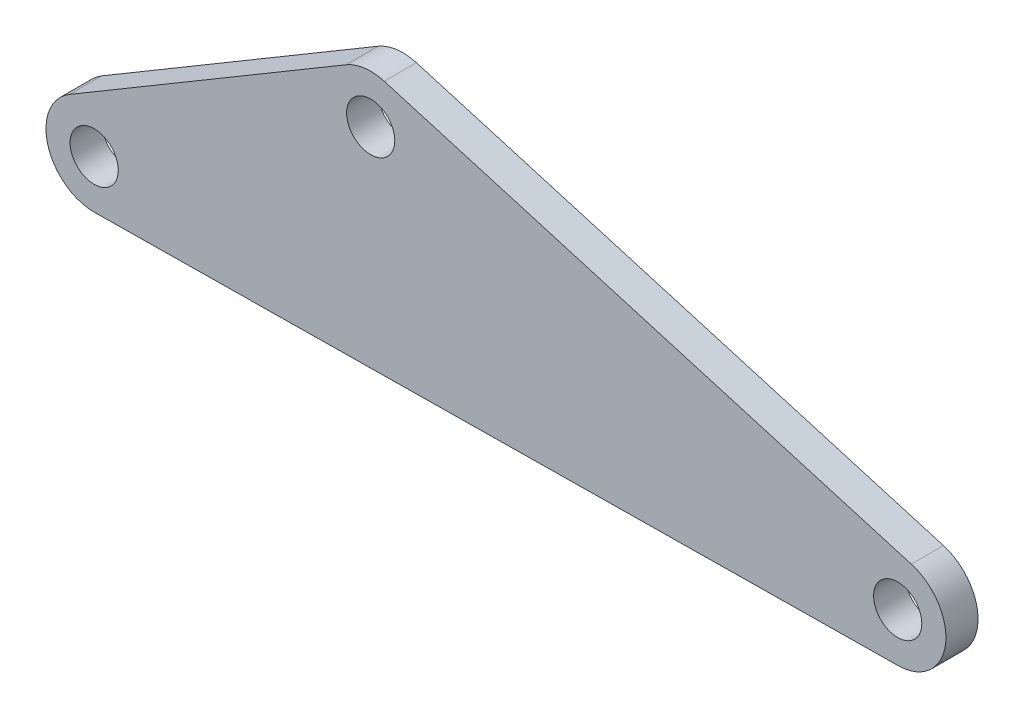
ISO-10303-21;
HEADER;
FILE_DESCRIPTION(('STEP AP214'),'2;1');
FILE_NAME('part.step','',(''),(''),'','','');
FILE_SCHEMA(('AUTOMOTIVE_DESIGN { 1 0 10303 214 1 1 1 1 }'));
ENDSEC;
DATA;
#1=APPLICATION_CONTEXT('core data for automotive mechanical design processes');
#2=APPLICATION_PROTOCOL_DEFINITION('international standard','automotive_design',2000,#1);
#3=PRODUCT_CONTEXT('',#1,'mechanical');
#4=PRODUCT('Part','Part','',(#3));
#5=PRODUCT_RELATED_PRODUCT_CATEGORY('part','',(#4));
#6=PRODUCT_DEFINITION_FORMATION('','',#4);
#7=PRODUCT_DEFINITION_CONTEXT('part definition',#1,'design');
#8=PRODUCT_DEFINITION('design','',#6,#7);
#9=PRODUCT_DEFINITION_SHAPE('','',#8);
#10=(LENGTH_UNIT() NAMED_UNIT(*) SI_UNIT(.MILLI.,.METRE.));
#11=(NAMED_UNIT(*) PLANE_ANGLE_UNIT() SI_UNIT($,.RADIAN.));
#12=(NAMED_UNIT(*) SI_UNIT($,.STERADIAN.) SOLID_ANGLE_UNIT());
#13=UNCERTAINTY_MEASURE_WITH_UNIT(LENGTH_MEASURE(1.E-05),#10,'distance_accuracy_value','');
#14=(GEOMETRIC_REPRESENTATION_CONTEXT(3) GLOBAL_UNCERTAINTY_ASSIGNED_CONTEXT((#13)) GLOBAL_UNIT_ASSIGNED_CONTEXT((#10,
#11,#12)) REPRESENTATION_CONTEXT('',''));
#15=CARTESIAN_POINT('',(0.,0.,0.));
#16=DIRECTION('',(0.,0.,1.));
#17=DIRECTION('',(1.,0.,0.));
#18=AXIS2_PLACEMENT_3D('',#15,#16,#17);
#19=CARTESIAN_POINT('',(0.,0.,10.));
#20=DIRECTION('',(0.,0.,-1.));
#21=DIRECTION('',(-1.,0.,0.));
#22=AXIS2_PLACEMENT_3D('',#19,#20,#21);
#23=PLANE('',#22);
#24=DIRECTION('',(-0.860200491908068,-0.509955991945499,0.));
#25=VECTOR('',#24,1.);
#26=CARTESIAN_POINT('',(-188.967985520979,-4.58778184542889,10.));
#27=LINE('',#26,#25);
#28=CARTESIAN_POINT('',(-54.7932572227223,74.9555424225933,10.));
#29=VERTEX_POINT('',#28);
#30=CARTESIAN_POINT('',(-140.813306413529,23.9599432280433,10.));
#31=VERTEX_POINT('',#30);
#32=EDGE_CURVE('E112',#29,#31,#27,.T.);
#33=ORIENTED_EDGE('',*,*,#32,.T.);
#34=CARTESIAN_POINT('',(-133.163966534347,11.0569358494223,10.));
#35=DIRECTION('',(0.,0.,-1.));
#36=DIRECTION('',(-1.,0.,0.));
#37=AXIS2_PLACEMENT_3D('',#34,#35,#36);
#38=CIRCLE('',#37,15.);
#39=CARTESIAN_POINT('',(-132.990947566104,-3.94206626527283,10.));
#40=VERTEX_POINT('',#39);
#41=EDGE_CURVE('E11',#31,#40,#38,.F.);
#42=ORIENTED_EDGE('',*,*,#41,.T.);
#43=DIRECTION('',(0.999933474313007,0.0115345978828672,0.));
#44=VECTOR('',#43,1.);
#45=CARTESIAN_POINT('',(217.267895036754,0.0982974270399466,10.));
#46=LINE('',#45,#44);
#47=CARTESIAN_POINT('',(116.992421012148,-1.05841679455603,10.));
#48=VERTEX_POINT('',#47);
#49=EDGE_CURVE('E123',#40,#48,#46,.T.);
#50=ORIENTED_EDGE('',*,*,#49,.T.);
#51=CARTESIAN_POINT('',(116.819402043905,13.9405853201391,10.));
#52=DIRECTION('',(0.,0.,-1.));
#53=DIRECTION('',(-1.,0.,0.));
#54=AXIS2_PLACEMENT_3D('',#51,#52,#53);
#55=CIRCLE('',#54,15.);
#56=CARTESIAN_POINT('',(121.042802245219,28.3337396213873,10.));
#57=VERTEX_POINT('',#56);
#58=EDGE_CURVE('E131',#48,#57,#55,.F.);
#59=ORIENTED_EDGE('',*,*,#58,.T.);
#60=DIRECTION('',(-0.959543620083218,0.281560013420927,0.));
#61=VECTOR('',#60,1.);
#62=CARTESIAN_POINT('',(-49.1809643787774,78.2826997437593,10.));
#63=LINE('',#62,#61);
#64=CARTESIAN_POINT('',(-42.9205171422259,76.4456893452205,10.));
#65=VERTEX_POINT('',#64);
#66=EDGE_CURVE('E110',#57,#65,#63,.T.);
#67=ORIENTED_EDGE('',*,*,#66,.T.);
#68=CARTESIAN_POINT('',(-47.1439173435398,62.0525350439722,10.));
#69=DIRECTION('',(0.,0.,-1.));
#70=DIRECTION('',(-1.,0.,0.));
#71=AXIS2_PLACEMENT_3D('',#68,#69,#70);
#72=CIRCLE('',#71,15.);
#73=EDGE_CURVE('E143',#65,#29,#72,.F.);
#74=ORIENTED_EDGE('',*,*,#73,.T.);
#75=EDGE_LOOP('',(#33,#42,#50,#59,#67,#74));
#76=FACE_BOUND('',#75,.T.);
#77=CARTESIAN_POINT('',(-133.163966534347,11.0569358494223,10.));
#78=DIRECTION('',(0.,0.,1.));
#79=DIRECTION('',(1.,0.,0.));
#80=AXIS2_PLACEMENT_3D('',#77,#78,#79);
#81=CIRCLE('',#80,7.50000000000001);
#82=CARTESIAN_POINT('',(-125.663966534347,11.0569358494223,10.));
#83=VERTEX_POINT('',#82);
#84=EDGE_CURVE('E125',#83,#83,#81,.T.);
#85=ORIENTED_EDGE('',*,*,#84,.F.);
#86=EDGE_LOOP('',(#85));
#87=FACE_BOUND('',#86,.T.);
#88=CARTESIAN_POINT('',(-47.1439173435398,62.0525350439722,10.));
#89=DIRECTION('',(0.,0.,1.));
#90=DIRECTION('',(1.,0.,0.));
#91=AXIS2_PLACEMENT_3D('',#88,#89,#90);
#92=CIRCLE('',#91,7.5);
#93=CARTESIAN_POINT('',(-39.6439173435398,62.0525350439722,10.));
#94=VERTEX_POINT('',#93);
#95=EDGE_CURVE('E164',#94,#94,#92,.T.);
#96=ORIENTED_EDGE('',*,*,#95,.F.);
#97=EDGE_LOOP('',(#96));
#98=FACE_BOUND('',#97,.T.);
#99=CARTESIAN_POINT('',(116.819402043905,13.9405853201391,10.));
#100=DIRECTION('',(0.,0.,1.));
#101=DIRECTION('',(1.,0.,0.));
#102=AXIS2_PLACEMENT_3D('',#99,#100,#101);
#103=CIRCLE('',#102,7.50000000000001);
#104=CARTESIAN_POINT('',(124.319402043905,13.9405853201391,10.));
#105=VERTEX_POINT('',#104);
#106=EDGE_CURVE('E172',#105,#105,#103,.T.);
#107=ORIENTED_EDGE('',*,*,#106,.F.);
#108=EDGE_LOOP('',(#107));
#109=FACE_BOUND('',#108,.T.);
#110=ADVANCED_FACE('F38',(#76,#87,#98,#109),#23,.F.);
#111=CARTESIAN_POINT('',(0.,0.,0.));
#112=DIRECTION('',(0.,0.,-1.));
#113=DIRECTION('',(-1.,0.,0.));
#114=AXIS2_PLACEMENT_3D('',#111,#112,#113);
#115=PLANE('',#114);
#116=CARTESIAN_POINT('',(-47.1439173435398,62.0525350439722,0.));
#117=DIRECTION('',(0.,0.,1.));
#118=DIRECTION('',(1.,0.,0.));
#119=AXIS2_PLACEMENT_3D('',#116,#117,#118);
#120=CIRCLE('',#119,7.5);
#121=CARTESIAN_POINT('',(-39.6439173435398,62.0525350439722,0.));
#122=VERTEX_POINT('',#121);
#123=EDGE_CURVE('E168',#122,#122,#120,.T.);
#124=ORIENTED_EDGE('',*,*,#123,.T.);
#125=EDGE_LOOP('',(#124));
#126=FACE_BOUND('',#125,.T.);
#127=DIRECTION('',(0.999933474313007,0.0115345978828672,0.));
#128=VECTOR('',#127,1.);
#129=CARTESIAN_POINT('',(217.267895036754,0.0982974270399466,0.));
#130=LINE('',#129,#128);
#131=CARTESIAN_POINT('',(-132.990947566104,-3.94206626527283,0.));
#132=VERTEX_POINT('',#131);
#133=CARTESIAN_POINT('',(116.992421012148,-1.05841679455603,0.));
#134=VERTEX_POINT('',#133);
#135=EDGE_CURVE('E119',#132,#134,#130,.T.);
#136=ORIENTED_EDGE('',*,*,#135,.F.);
#137=CARTESIAN_POINT('',(-133.163966534347,11.0569358494223,0.));
#138=DIRECTION('',(0.,0.,-1.));
#139=DIRECTION('',(-1.,0.,0.));
#140=AXIS2_PLACEMENT_3D('',#137,#138,#139);
#141=CIRCLE('',#140,15.);
#142=CARTESIAN_POINT('',(-140.813306413529,23.9599432280433,0.));
#143=VERTEX_POINT('',#142);
#144=EDGE_CURVE('E61',#132,#143,#141,.T.);
#145=ORIENTED_EDGE('',*,*,#144,.T.);
#146=DIRECTION('',(-0.860200491908068,-0.509955991945499,0.));
#147=VECTOR('',#146,1.);
#148=CARTESIAN_POINT('',(-188.967985520979,-4.58778184542889,0.));
#149=LINE('',#148,#147);
#150=CARTESIAN_POINT('',(-54.7932572227223,74.9555424225933,0.));
#151=VERTEX_POINT('',#150);
#152=EDGE_CURVE('E118',#151,#143,#149,.T.);
#153=ORIENTED_EDGE('',*,*,#152,.F.);
#154=CARTESIAN_POINT('',(-47.1439173435398,62.0525350439722,0.));
#155=DIRECTION('',(0.,0.,-1.));
#156=DIRECTION('',(-1.,0.,0.));
#157=AXIS2_PLACEMENT_3D('',#154,#155,#156);
#158=CIRCLE('',#157,15.);
#159=CARTESIAN_POINT('',(-42.9205171422259,76.4456893452205,0.));
#160=VERTEX_POINT('',#159);
#161=EDGE_CURVE('E116',#151,#160,#158,.T.);
#162=ORIENTED_EDGE('',*,*,#161,.T.);
#163=DIRECTION('',(-0.959543620083218,0.281560013420927,0.));
#164=VECTOR('',#163,1.);
#165=CARTESIAN_POINT('',(-49.1809643787774,78.2826997437593,0.));
#166=LINE('',#165,#164);
#167=CARTESIAN_POINT('',(121.042802245219,28.3337396213873,0.));
#168=VERTEX_POINT('',#167);
#169=EDGE_CURVE('E107',#168,#160,#166,.T.);
#170=ORIENTED_EDGE('',*,*,#169,.F.);
#171=CARTESIAN_POINT('',(116.819402043905,13.9405853201391,0.));
#172=DIRECTION('',(0.,0.,-1.));
#173=DIRECTION('',(-1.,0.,0.));
#174=AXIS2_PLACEMENT_3D('',#171,#172,#173);
#175=CIRCLE('',#174,15.);
#176=EDGE_CURVE('E93',#168,#134,#175,.T.);
#177=ORIENTED_EDGE('',*,*,#176,.T.);
#178=EDGE_LOOP('',(#136,#145,#153,#162,#170,#177));
#179=FACE_BOUND('',#178,.T.);
#180=CARTESIAN_POINT('',(-133.163966534347,11.0569358494223,0.));
#181=DIRECTION('',(0.,0.,1.));
#182=DIRECTION('',(1.,0.,0.));
#183=AXIS2_PLACEMENT_3D('',#180,#181,#182);
#184=CIRCLE('',#183,7.50000000000001);
#185=CARTESIAN_POINT('',(-125.663966534347,11.0569358494223,0.));
#186=VERTEX_POINT('',#185);
#187=EDGE_CURVE('E160',#186,#186,#184,.T.);
#188=ORIENTED_EDGE('',*,*,#187,.T.);
#189=EDGE_LOOP('',(#188));
#190=FACE_BOUND('',#189,.T.);
#191=CARTESIAN_POINT('',(116.819402043905,13.9405853201391,0.));
#192=DIRECTION('',(0.,0.,1.));
#193=DIRECTION('',(1.,0.,0.));
#194=AXIS2_PLACEMENT_3D('',#191,#192,#193);
#195=CIRCLE('',#194,7.50000000000001);
#196=CARTESIAN_POINT('',(124.319402043905,13.9405853201391,0.));
#197=VERTEX_POINT('',#196);
#198=EDGE_CURVE('E176',#197,#197,#195,.T.);
#199=ORIENTED_EDGE('',*,*,#198,.T.);
#200=EDGE_LOOP('',(#199));
#201=FACE_BOUND('',#200,.T.);
#202=ADVANCED_FACE('F114',(#126,#179,#190,#201),#115,.T.);
#203=CARTESIAN_POINT('',(217.267895036754,0.0982974270399466,10.));
#204=DIRECTION('',(-0.0115345978828672,0.999933474313007,0.));
#205=DIRECTION('',(-0.999933474313007,-0.0115345978828672,0.));
#206=AXIS2_PLACEMENT_3D('',#203,#204,#205);
#207=PLANE('',#206);
#208=ORIENTED_EDGE('',*,*,#49,.F.);
#209=DIRECTION('',(0.,0.,-1.));
#210=VECTOR('',#209,1.);
#211=CARTESIAN_POINT('',(-132.990947566104,-3.94206626527283,10.));
#212=LINE('',#211,#210);
#213=EDGE_CURVE('E146',#40,#132,#212,.T.);
#214=ORIENTED_EDGE('',*,*,#213,.T.);
#215=ORIENTED_EDGE('',*,*,#135,.T.);
#216=DIRECTION('',(0.,0.,-1.));
#217=VECTOR('',#216,1.);
#218=CARTESIAN_POINT('',(116.992421012148,-1.05841679455603,10.));
#219=LINE('',#218,#217);
#220=EDGE_CURVE('E99',#134,#48,#219,.F.);
#221=ORIENTED_EDGE('',*,*,#220,.T.);
#222=EDGE_LOOP('',(#208,#214,#215,#221));
#223=FACE_BOUND('',#222,.T.);
#224=ADVANCED_FACE('F193',(#223),#207,.F.);
#225=CARTESIAN_POINT('',(-49.1809643787774,78.2826997437593,10.));
#226=DIRECTION('',(-0.281560013420927,-0.959543620083218,0.));
#227=DIRECTION('',(0.959543620083218,-0.281560013420927,0.));
#228=AXIS2_PLACEMENT_3D('',#225,#226,#227);
#229=PLANE('',#228);
#230=ORIENTED_EDGE('',*,*,#169,.T.);
#231=DIRECTION('',(0.,0.,-1.));
#232=VECTOR('',#231,1.);
#233=CARTESIAN_POINT('',(-42.9205171422259,76.4456893452205,10.));
#234=LINE('',#233,#232);
#235=EDGE_CURVE('E140',#160,#65,#234,.F.);
#236=ORIENTED_EDGE('',*,*,#235,.T.);
#237=ORIENTED_EDGE('',*,*,#66,.F.);
#238=DIRECTION('',(0.,0.,-1.));
#239=VECTOR('',#238,1.);
#240=CARTESIAN_POINT('',(121.042802245219,28.3337396213873,10.));
#241=LINE('',#240,#239);
#242=EDGE_CURVE('E97',#57,#168,#241,.T.);
#243=ORIENTED_EDGE('',*,*,#242,.T.);
#244=EDGE_LOOP('',(#230,#236,#237,#243));
#245=FACE_BOUND('',#244,.T.);
#246=ADVANCED_FACE('F106',(#245),#229,.F.);
#247=CARTESIAN_POINT('',(-188.967985520979,-4.58778184542889,10.));
#248=DIRECTION('',(0.509955991945499,-0.860200491908068,0.));
#249=DIRECTION('',(0.860200491908068,0.509955991945499,0.));
#250=AXIS2_PLACEMENT_3D('',#247,#248,#249);
#251=PLANE('',#250);
#252=ORIENTED_EDGE('',*,*,#152,.T.);
#253=DIRECTION('',(0.,0.,-1.));
#254=VECTOR('',#253,1.);
#255=CARTESIAN_POINT('',(-140.813306413529,23.9599432280433,10.));
#256=LINE('',#255,#254);
#257=EDGE_CURVE('E47',#143,#31,#256,.F.);
#258=ORIENTED_EDGE('',*,*,#257,.T.);
#259=ORIENTED_EDGE('',*,*,#32,.F.);
#260=DIRECTION('',(0.,0.,-1.));
#261=VECTOR('',#260,1.);
#262=CARTESIAN_POINT('',(-54.7932572227223,74.9555424225933,10.));
#263=LINE('',#262,#261);
#264=EDGE_CURVE('E134',#29,#151,#263,.T.);
#265=ORIENTED_EDGE('',*,*,#264,.T.);
#266=EDGE_LOOP('',(#252,#258,#259,#265));
#267=FACE_BOUND('',#266,.T.);
#268=ADVANCED_FACE('F201',(#267),#251,.F.);
#269=CARTESIAN_POINT('',(-133.163966534347,11.0569358494223,10.));
#270=DIRECTION('',(0.,0.,-1.));
#271=DIRECTION('',(-1.,0.,0.));
#272=AXIS2_PLACEMENT_3D('',#269,#270,#271);
#273=CYLINDRICAL_SURFACE('',#272,7.50000000000001);
#274=ORIENTED_EDGE('',*,*,#84,.T.);
#275=EDGE_LOOP('',(#274));
#276=FACE_BOUND('',#275,.T.);
#277=ORIENTED_EDGE('',*,*,#187,.F.);
#278=EDGE_LOOP('',(#277));
#279=FACE_BOUND('',#278,.T.);
#280=ADVANCED_FACE('F198',(#276,#279),#273,.F.);
#281=CARTESIAN_POINT('',(-47.1439173435398,62.0525350439722,10.));
#282=DIRECTION('',(0.,0.,-1.));
#283=DIRECTION('',(-1.,0.,0.));
#284=AXIS2_PLACEMENT_3D('',#281,#282,#283);
#285=CYLINDRICAL_SURFACE('',#284,7.5);
#286=ORIENTED_EDGE('',*,*,#95,.T.);
#287=EDGE_LOOP('',(#286));
#288=FACE_BOUND('',#287,.T.);
#289=ORIENTED_EDGE('',*,*,#123,.F.);
#290=EDGE_LOOP('',(#289));
#291=FACE_BOUND('',#290,.T.);
#292=ADVANCED_FACE('F260',(#288,#291),#285,.F.);
#293=CARTESIAN_POINT('',(116.819402043905,13.9405853201391,10.));
#294=DIRECTION('',(0.,0.,-1.));
#295=DIRECTION('',(-1.,0.,0.));
#296=AXIS2_PLACEMENT_3D('',#293,#294,#295);
#297=CYLINDRICAL_SURFACE('',#296,7.50000000000001);
#298=ORIENTED_EDGE('',*,*,#106,.T.);
#299=EDGE_LOOP('',(#298));
#300=FACE_BOUND('',#299,.T.);
#301=ORIENTED_EDGE('',*,*,#198,.F.);
#302=EDGE_LOOP('',(#301));
#303=FACE_BOUND('',#302,.T.);
#304=ADVANCED_FACE('F184',(#300,#303),#297,.F.);
#305=CARTESIAN_POINT('',(116.819402043905,13.9405853201391,10.));
#306=DIRECTION('',(0.,0.,-1.));
#307=DIRECTION('',(-1.,0.,0.));
#308=AXIS2_PLACEMENT_3D('',#305,#306,#307);
#309=CYLINDRICAL_SURFACE('',#308,15.);
#310=ORIENTED_EDGE('',*,*,#58,.F.);
#311=ORIENTED_EDGE('',*,*,#220,.F.);
#312=ORIENTED_EDGE('',*,*,#176,.F.);
#313=ORIENTED_EDGE('',*,*,#242,.F.);
#314=EDGE_LOOP('',(#310,#311,#312,#313));
#315=FACE_BOUND('',#314,.T.);
#316=ADVANCED_FACE('F96',(#315),#309,.T.);
#317=CARTESIAN_POINT('',(-47.1439173435398,62.0525350439722,10.));
#318=DIRECTION('',(0.,0.,-1.));
#319=DIRECTION('',(-1.,0.,0.));
#320=AXIS2_PLACEMENT_3D('',#317,#318,#319);
#321=CYLINDRICAL_SURFACE('',#320,15.);
#322=ORIENTED_EDGE('',*,*,#73,.F.);
#323=ORIENTED_EDGE('',*,*,#235,.F.);
#324=ORIENTED_EDGE('',*,*,#161,.F.);
#325=ORIENTED_EDGE('',*,*,#264,.F.);
#326=EDGE_LOOP('',(#322,#323,#324,#325));
#327=FACE_BOUND('',#326,.T.);
#328=ADVANCED_FACE('F210',(#327),#321,.T.);
#329=CARTESIAN_POINT('',(-133.163966534347,11.0569358494223,10.));
#330=DIRECTION('',(0.,0.,-1.));
#331=DIRECTION('',(-1.,0.,0.));
#332=AXIS2_PLACEMENT_3D('',#329,#330,#331);
#333=CYLINDRICAL_SURFACE('',#332,15.);
#334=ORIENTED_EDGE('',*,*,#41,.F.);
#335=ORIENTED_EDGE('',*,*,#257,.F.);
#336=ORIENTED_EDGE('',*,*,#144,.F.);
#337=ORIENTED_EDGE('',*,*,#213,.F.);
#338=EDGE_LOOP('',(#334,#335,#336,#337));
#339=FACE_BOUND('',#338,.T.);
#340=ADVANCED_FACE('F40',(#339),#333,.T.);
#341=CLOSED_SHELL('',(#110,#202,#224,#246,#268,#280,#292,#304,#316,#328,#340));
#342=MANIFOLD_SOLID_BREP('B2',#341);
#343=ADVANCED_BREP_SHAPE_REPRESENTATION('',(#18,#342),#14);
#344=SHAPE_DEFINITION_REPRESENTATION(#9,#343);
ENDSEC;
END-ISO-10303-21;
